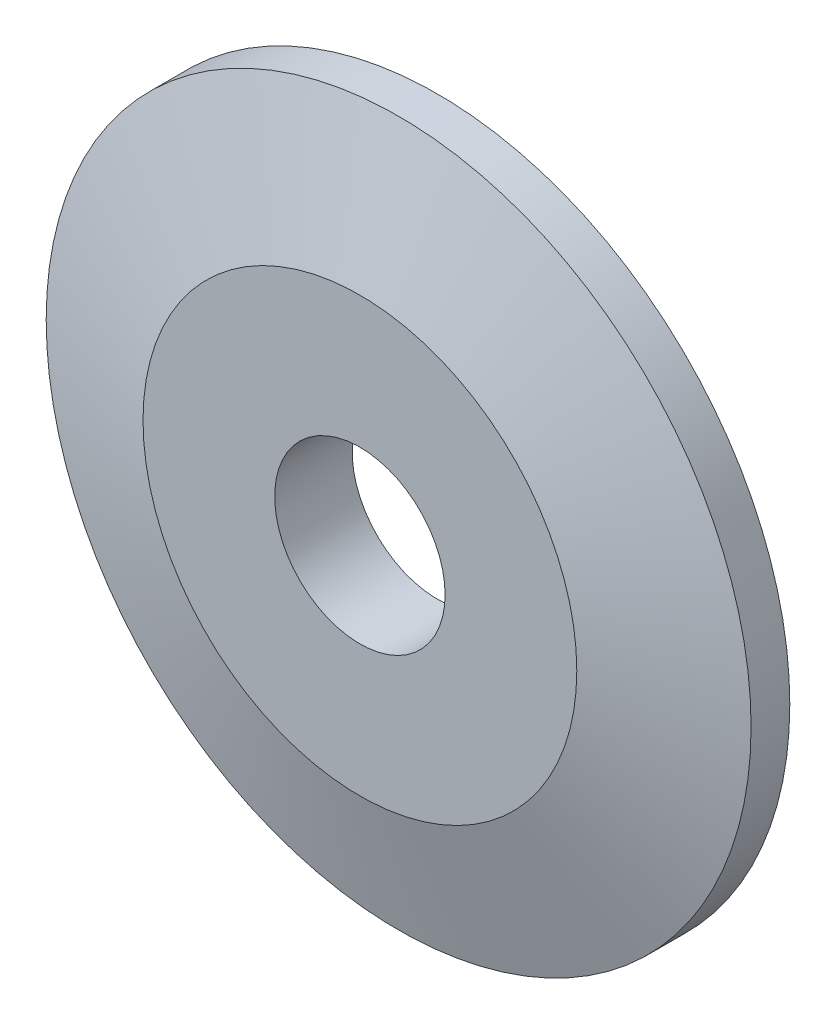
ISO-10303-21;
HEADER;
FILE_DESCRIPTION(('STEP AP214'),'2;1');
FILE_NAME('part.step','',(''),(''),'','','');
FILE_SCHEMA(('AUTOMOTIVE_DESIGN { 1 0 10303 214 1 1 1 1 }'));
ENDSEC;
DATA;
#1=APPLICATION_CONTEXT('core data for automotive mechanical design processes');
#2=APPLICATION_PROTOCOL_DEFINITION('international standard','automotive_design',2000,#1);
#3=PRODUCT_CONTEXT('',#1,'mechanical');
#4=PRODUCT('Part','Part','',(#3));
#5=PRODUCT_RELATED_PRODUCT_CATEGORY('part','',(#4));
#6=PRODUCT_DEFINITION_FORMATION('','',#4);
#7=PRODUCT_DEFINITION_CONTEXT('part definition',#1,'design');
#8=PRODUCT_DEFINITION('design','',#6,#7);
#9=PRODUCT_DEFINITION_SHAPE('','',#8);
#10=(LENGTH_UNIT() NAMED_UNIT(*) SI_UNIT(.MILLI.,.METRE.));
#11=(NAMED_UNIT(*) PLANE_ANGLE_UNIT() SI_UNIT($,.RADIAN.));
#12=(NAMED_UNIT(*) SI_UNIT($,.STERADIAN.) SOLID_ANGLE_UNIT());
#13=UNCERTAINTY_MEASURE_WITH_UNIT(LENGTH_MEASURE(1.E-05),#10,'distance_accuracy_value','');
#14=(GEOMETRIC_REPRESENTATION_CONTEXT(3) GLOBAL_UNCERTAINTY_ASSIGNED_CONTEXT((#13)) GLOBAL_UNIT_ASSIGNED_CONTEXT((#10,
#11,#12)) REPRESENTATION_CONTEXT('',''));
#15=CARTESIAN_POINT('',(0.,0.,0.));
#16=DIRECTION('',(0.,0.,1.));
#17=DIRECTION('',(1.,0.,0.));
#18=AXIS2_PLACEMENT_3D('',#15,#16,#17);
#19=CARTESIAN_POINT('',(0.,0.,460.221468248641));
#20=DIRECTION('',(0.,0.,-1.));
#21=DIRECTION('',(-1.,0.,0.));
#22=AXIS2_PLACEMENT_3D('',#19,#20,#21);
#23=PLANE('',#22);
#24=CARTESIAN_POINT('',(0.,19.55,460.221468248641));
#25=DIRECTION('',(0.,0.,1.));
#26=DIRECTION('',(1.,0.,0.));
#27=AXIS2_PLACEMENT_3D('',#24,#25,#26);
#28=CIRCLE('',#27,1.09999999999999);
#29=CARTESIAN_POINT('',(1.09999999999999,19.55,460.221468248641));
#30=VERTEX_POINT('',#29);
#31=EDGE_CURVE('E52',#30,#30,#28,.T.);
#32=ORIENTED_EDGE('',*,*,#31,.T.);
#33=EDGE_LOOP('',(#32));
#34=FACE_BOUND('',#33,.T.);
#35=CARTESIAN_POINT('',(0.,19.55,460.221468248641));
#36=DIRECTION('',(0.,0.,1.));
#37=DIRECTION('',(1.,0.,0.));
#38=AXIS2_PLACEMENT_3D('',#35,#36,#37);
#39=CIRCLE('',#38,4.55);
#40=CARTESIAN_POINT('',(4.55,19.55,460.221468248641));
#41=VERTEX_POINT('',#40);
#42=EDGE_CURVE('E10',#41,#41,#39,.T.);
#43=ORIENTED_EDGE('',*,*,#42,.F.);
#44=EDGE_LOOP('',(#43));
#45=FACE_BOUND('',#44,.T.);
#46=ADVANCED_FACE('F33',(#34,#45),#23,.T.);
#47=CARTESIAN_POINT('',(0.,19.55,470.158968248641));
#48=DIRECTION('',(0.,0.,1.));
#49=DIRECTION('',(1.,0.,0.));
#50=AXIS2_PLACEMENT_3D('',#47,#48,#49);
#51=CYLINDRICAL_SURFACE('',#50,4.55);
#52=ORIENTED_EDGE('',*,*,#42,.T.);
#53=EDGE_LOOP('',(#52));
#54=FACE_BOUND('',#53,.T.);
#55=CARTESIAN_POINT('',(0.,19.55,460.721468248641));
#56=DIRECTION('',(0.,0.,1.));
#57=DIRECTION('',(1.,0.,0.));
#58=AXIS2_PLACEMENT_3D('',#55,#56,#57);
#59=CIRCLE('',#58,4.54999999999999);
#60=CARTESIAN_POINT('',(4.54999999999999,19.55,460.721468248641));
#61=VERTEX_POINT('',#60);
#62=EDGE_CURVE('E39',#61,#61,#59,.T.);
#63=ORIENTED_EDGE('',*,*,#62,.F.);
#64=EDGE_LOOP('',(#63));
#65=FACE_BOUND('',#64,.T.);
#66=ADVANCED_FACE('F72',(#54,#65),#51,.T.);
#67=CARTESIAN_POINT('',(0.,19.55,461.221468248641));
#68=DIRECTION('',(0.,0.,-1.));
#69=DIRECTION('',(-1.,0.,0.));
#70=AXIS2_PLACEMENT_3D('',#67,#68,#69);
#71=CONICAL_SURFACE('',#70,2.79999999999999,1.29249666778976);
#72=ORIENTED_EDGE('',*,*,#62,.T.);
#73=EDGE_LOOP('',(#72));
#74=FACE_BOUND('',#73,.T.);
#75=CARTESIAN_POINT('',(0.,19.55,461.221468248641));
#76=DIRECTION('',(0.,0.,1.));
#77=DIRECTION('',(1.,0.,0.));
#78=AXIS2_PLACEMENT_3D('',#75,#76,#77);
#79=CIRCLE('',#78,2.79999999999999);
#80=CARTESIAN_POINT('',(2.79999999999999,19.55,461.221468248641));
#81=VERTEX_POINT('',#80);
#82=EDGE_CURVE('E43',#81,#81,#79,.T.);
#83=ORIENTED_EDGE('',*,*,#82,.F.);
#84=EDGE_LOOP('',(#83));
#85=FACE_BOUND('',#84,.T.);
#86=ADVANCED_FACE('F67',(#74,#85),#71,.T.);
#87=CARTESIAN_POINT('',(0.,0.,461.221468248641));
#88=DIRECTION('',(0.,0.,-1.));
#89=DIRECTION('',(-1.,0.,0.));
#90=AXIS2_PLACEMENT_3D('',#87,#88,#89);
#91=PLANE('',#90);
#92=CARTESIAN_POINT('',(0.,19.55,461.221468248641));
#93=DIRECTION('',(0.,0.,1.));
#94=DIRECTION('',(1.,0.,0.));
#95=AXIS2_PLACEMENT_3D('',#92,#93,#94);
#96=CIRCLE('',#95,1.09999999999999);
#97=CARTESIAN_POINT('',(1.09999999999999,19.55,461.221468248641));
#98=VERTEX_POINT('',#97);
#99=EDGE_CURVE('E47',#98,#98,#96,.T.);
#100=ORIENTED_EDGE('',*,*,#99,.F.);
#101=EDGE_LOOP('',(#100));
#102=FACE_BOUND('',#101,.T.);
#103=ORIENTED_EDGE('',*,*,#82,.T.);
#104=EDGE_LOOP('',(#103));
#105=FACE_BOUND('',#104,.T.);
#106=ADVANCED_FACE('F61',(#102,#105),#91,.F.);
#107=CARTESIAN_POINT('',(0.,19.55,470.158968248641));
#108=DIRECTION('',(0.,0.,1.));
#109=DIRECTION('',(1.,0.,0.));
#110=AXIS2_PLACEMENT_3D('',#107,#108,#109);
#111=CYLINDRICAL_SURFACE('',#110,1.09999999999999);
#112=ORIENTED_EDGE('',*,*,#31,.F.);
#113=EDGE_LOOP('',(#112));
#114=FACE_BOUND('',#113,.T.);
#115=ORIENTED_EDGE('',*,*,#99,.T.);
#116=EDGE_LOOP('',(#115));
#117=FACE_BOUND('',#116,.T.);
#118=ADVANCED_FACE('F58',(#114,#117),#111,.F.);
#119=CLOSED_SHELL('',(#46,#66,#86,#106,#118));
#120=MANIFOLD_SOLID_BREP('B2',#119);
#121=ADVANCED_BREP_SHAPE_REPRESENTATION('',(#18,#120),#14);
#122=SHAPE_DEFINITION_REPRESENTATION(#9,#121);
ENDSEC;
END-ISO-10303-21;
